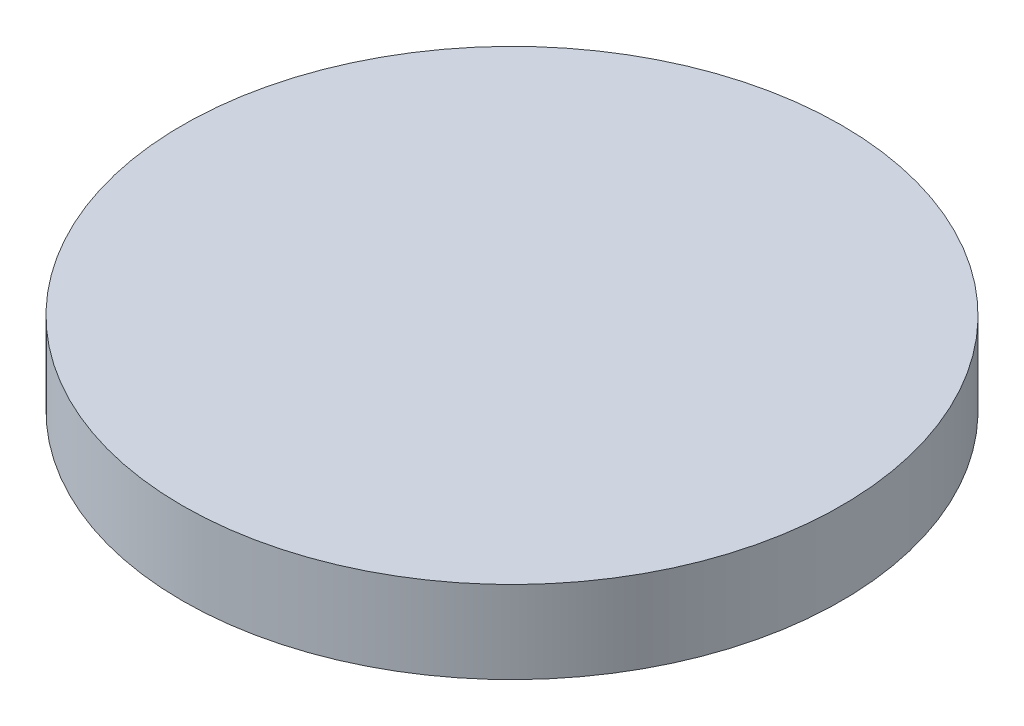
ISO-10303-21;
HEADER;
FILE_DESCRIPTION(('STEP AP214'),'2;1');
FILE_NAME('part.step','',(''),(''),'','','');
FILE_SCHEMA(('AUTOMOTIVE_DESIGN { 1 0 10303 214 1 1 1 1 }'));
ENDSEC;
DATA;
#1=APPLICATION_CONTEXT('core data for automotive mechanical design processes');
#2=APPLICATION_PROTOCOL_DEFINITION('international standard','automotive_design',2000,#1);
#3=PRODUCT_CONTEXT('',#1,'mechanical');
#4=PRODUCT('Part','Part','',(#3));
#5=PRODUCT_RELATED_PRODUCT_CATEGORY('part','',(#4));
#6=PRODUCT_DEFINITION_FORMATION('','',#4);
#7=PRODUCT_DEFINITION_CONTEXT('part definition',#1,'design');
#8=PRODUCT_DEFINITION('design','',#6,#7);
#9=PRODUCT_DEFINITION_SHAPE('','',#8);
#10=(LENGTH_UNIT() NAMED_UNIT(*) SI_UNIT(.MILLI.,.METRE.));
#11=(NAMED_UNIT(*) PLANE_ANGLE_UNIT() SI_UNIT($,.RADIAN.));
#12=(NAMED_UNIT(*) SI_UNIT($,.STERADIAN.) SOLID_ANGLE_UNIT());
#13=UNCERTAINTY_MEASURE_WITH_UNIT(LENGTH_MEASURE(1.E-05),#10,'distance_accuracy_value','');
#14=(GEOMETRIC_REPRESENTATION_CONTEXT(3) GLOBAL_UNCERTAINTY_ASSIGNED_CONTEXT((#13)) GLOBAL_UNIT_ASSIGNED_CONTEXT((#10,
#11,#12)) REPRESENTATION_CONTEXT('',''));
#15=CARTESIAN_POINT('',(0.,0.,0.));
#16=DIRECTION('',(0.,0.,1.));
#17=DIRECTION('',(1.,0.,0.));
#18=AXIS2_PLACEMENT_3D('',#15,#16,#17);
#19=CARTESIAN_POINT('',(0.,3.175,0.));
#20=DIRECTION('',(0.,-1.,0.));
#21=DIRECTION('',(0.,0.,-1.));
#22=AXIS2_PLACEMENT_3D('',#19,#20,#21);
#23=CYLINDRICAL_SURFACE('',#22,12.7);
#24=CARTESIAN_POINT('',(0.,3.175,0.));
#25=DIRECTION('',(0.,1.,0.));
#26=DIRECTION('',(0.,0.,1.));
#27=AXIS2_PLACEMENT_3D('',#24,#25,#26);
#28=CIRCLE('',#27,12.7);
#29=CARTESIAN_POINT('',(0.,3.175,12.7));
#30=VERTEX_POINT('',#29);
#31=EDGE_CURVE('E10',#30,#30,#28,.T.);
#32=ORIENTED_EDGE('',*,*,#31,.F.);
#33=EDGE_LOOP('',(#32));
#34=FACE_BOUND('',#33,.T.);
#35=CARTESIAN_POINT('',(0.,0.,0.));
#36=DIRECTION('',(0.,1.,0.));
#37=DIRECTION('',(0.,0.,1.));
#38=AXIS2_PLACEMENT_3D('',#35,#36,#37);
#39=CIRCLE('',#38,12.7);
#40=CARTESIAN_POINT('',(0.,0.,12.7));
#41=VERTEX_POINT('',#40);
#42=EDGE_CURVE('E40',#41,#41,#39,.T.);
#43=ORIENTED_EDGE('',*,*,#42,.T.);
#44=EDGE_LOOP('',(#43));
#45=FACE_BOUND('',#44,.T.);
#46=ADVANCED_FACE('F37',(#34,#45),#23,.T.);
#47=CARTESIAN_POINT('',(0.,3.175,0.));
#48=DIRECTION('',(0.,1.,0.));
#49=DIRECTION('',(0.,0.,1.));
#50=AXIS2_PLACEMENT_3D('',#47,#48,#49);
#51=PLANE('',#50);
#52=ORIENTED_EDGE('',*,*,#31,.T.);
#53=EDGE_LOOP('',(#52));
#54=FACE_BOUND('',#53,.T.);
#55=ADVANCED_FACE('F52',(#54),#51,.T.);
#56=CARTESIAN_POINT('',(0.,0.,0.));
#57=DIRECTION('',(0.,1.,0.));
#58=DIRECTION('',(0.,0.,1.));
#59=AXIS2_PLACEMENT_3D('',#56,#57,#58);
#60=PLANE('',#59);
#61=ORIENTED_EDGE('',*,*,#42,.F.);
#62=EDGE_LOOP('',(#61));
#63=FACE_BOUND('',#62,.T.);
#64=ADVANCED_FACE('F50',(#63),#60,.F.);
#65=CLOSED_SHELL('',(#46,#55,#64));
#66=MANIFOLD_SOLID_BREP('B2',#65);
#67=ADVANCED_BREP_SHAPE_REPRESENTATION('',(#18,#66),#14);
#68=SHAPE_DEFINITION_REPRESENTATION(#9,#67);
ENDSEC;
END-ISO-10303-21;
